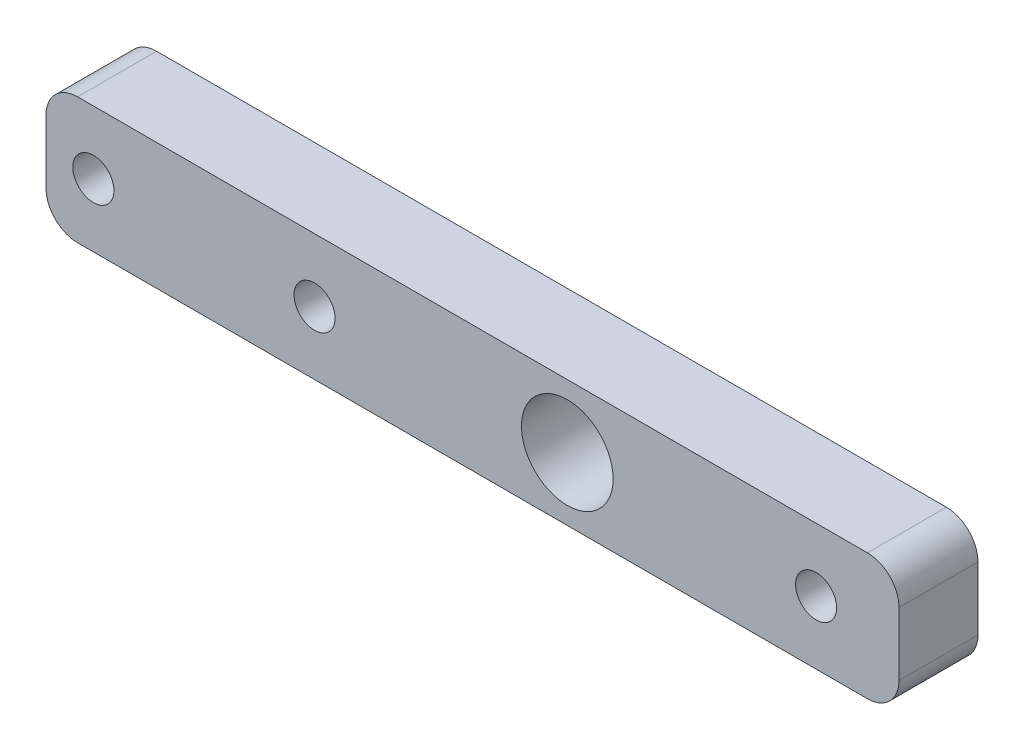
ISO-10303-21;
HEADER;
FILE_DESCRIPTION(('STEP AP214'),'2;1');
FILE_NAME('part.step','',(''),(''),'','','');
FILE_SCHEMA(('AUTOMOTIVE_DESIGN { 1 0 10303 214 1 1 1 1 }'));
ENDSEC;
DATA;
#1=APPLICATION_CONTEXT('core data for automotive mechanical design processes');
#2=APPLICATION_PROTOCOL_DEFINITION('international standard','automotive_design',2000,#1);
#3=PRODUCT_CONTEXT('',#1,'mechanical');
#4=PRODUCT('Part','Part','',(#3));
#5=PRODUCT_RELATED_PRODUCT_CATEGORY('part','',(#4));
#6=PRODUCT_DEFINITION_FORMATION('','',#4);
#7=PRODUCT_DEFINITION_CONTEXT('part definition',#1,'design');
#8=PRODUCT_DEFINITION('design','',#6,#7);
#9=PRODUCT_DEFINITION_SHAPE('','',#8);
#10=(LENGTH_UNIT() NAMED_UNIT(*) SI_UNIT(.MILLI.,.METRE.));
#11=(NAMED_UNIT(*) PLANE_ANGLE_UNIT() SI_UNIT($,.RADIAN.));
#12=(NAMED_UNIT(*) SI_UNIT($,.STERADIAN.) SOLID_ANGLE_UNIT());
#13=UNCERTAINTY_MEASURE_WITH_UNIT(LENGTH_MEASURE(1.E-05),#10,'distance_accuracy_value','');
#14=(GEOMETRIC_REPRESENTATION_CONTEXT(3) GLOBAL_UNCERTAINTY_ASSIGNED_CONTEXT((#13)) GLOBAL_UNIT_ASSIGNED_CONTEXT((#10,
#11,#12)) REPRESENTATION_CONTEXT('',''));
#15=CARTESIAN_POINT('',(0.,0.,0.));
#16=DIRECTION('',(0.,0.,1.));
#17=DIRECTION('',(1.,0.,0.));
#18=AXIS2_PLACEMENT_3D('',#15,#16,#17);
#19=CARTESIAN_POINT('',(-25.,2.,5.));
#20=DIRECTION('',(0.,0.,-1.));
#21=DIRECTION('',(-1.,0.,0.));
#22=AXIS2_PLACEMENT_3D('',#19,#20,#21);
#23=PLANE('',#22);
#24=CARTESIAN_POINT('',(-24.,0.,5.));
#25=DIRECTION('',(0.,0.,1.));
#26=DIRECTION('',(1.,0.,0.));
#27=AXIS2_PLACEMENT_3D('',#24,#25,#26);
#28=CIRCLE('',#27,1.3);
#29=CARTESIAN_POINT('',(-22.7,0.,5.));
#30=VERTEX_POINT('',#29);
#31=EDGE_CURVE('E207',#30,#30,#28,.T.);
#32=ORIENTED_EDGE('',*,*,#31,.F.);
#33=EDGE_LOOP('',(#32));
#34=FACE_BOUND('',#33,.T.);
#35=CARTESIAN_POINT('',(-10.,0.,5.));
#36=DIRECTION('',(0.,0.,1.));
#37=DIRECTION('',(1.,0.,0.));
#38=AXIS2_PLACEMENT_3D('',#35,#36,#37);
#39=CIRCLE('',#38,1.29999999999999);
#40=CARTESIAN_POINT('',(-8.70000000000001,0.,5.));
#41=VERTEX_POINT('',#40);
#42=EDGE_CURVE('E195',#41,#41,#39,.T.);
#43=ORIENTED_EDGE('',*,*,#42,.F.);
#44=EDGE_LOOP('',(#43));
#45=FACE_BOUND('',#44,.T.);
#46=CARTESIAN_POINT('',(-25.,2.,5.));
#47=DIRECTION('',(0.,0.,-1.));
#48=DIRECTION('',(-1.,0.,0.));
#49=AXIS2_PLACEMENT_3D('',#46,#47,#48);
#50=CIRCLE('',#49,2.);
#51=CARTESIAN_POINT('',(-27.,2.,5.));
#52=VERTEX_POINT('',#51);
#53=CARTESIAN_POINT('',(-25.,4.,5.));
#54=VERTEX_POINT('',#53);
#55=EDGE_CURVE('E157',#52,#54,#50,.T.);
#56=ORIENTED_EDGE('',*,*,#55,.F.);
#57=DIRECTION('',(0.,-1.,0.));
#58=VECTOR('',#57,1.);
#59=CARTESIAN_POINT('',(-27.,2.,5.));
#60=LINE('',#59,#58);
#61=CARTESIAN_POINT('',(-27.,-2.,5.));
#62=VERTEX_POINT('',#61);
#63=EDGE_CURVE('E116',#52,#62,#60,.T.);
#64=ORIENTED_EDGE('',*,*,#63,.T.);
#65=CARTESIAN_POINT('',(-25.,-2.,5.));
#66=DIRECTION('',(0.,0.,1.));
#67=DIRECTION('',(1.,0.,0.));
#68=AXIS2_PLACEMENT_3D('',#65,#66,#67);
#69=CIRCLE('',#68,2.);
#70=CARTESIAN_POINT('',(-25.,-4.,5.));
#71=VERTEX_POINT('',#70);
#72=EDGE_CURVE('E109',#62,#71,#69,.T.);
#73=ORIENTED_EDGE('',*,*,#72,.T.);
#74=DIRECTION('',(1.,0.,0.));
#75=VECTOR('',#74,1.);
#76=CARTESIAN_POINT('',(-25.,-4.,5.));
#77=LINE('',#76,#75);
#78=CARTESIAN_POINT('',(25.,-4.,5.));
#79=VERTEX_POINT('',#78);
#80=EDGE_CURVE('E114',#71,#79,#77,.T.);
#81=ORIENTED_EDGE('',*,*,#80,.T.);
#82=CARTESIAN_POINT('',(25.,-2.,5.));
#83=DIRECTION('',(0.,0.,1.));
#84=DIRECTION('',(1.,0.,0.));
#85=AXIS2_PLACEMENT_3D('',#82,#83,#84);
#86=CIRCLE('',#85,2.);
#87=CARTESIAN_POINT('',(27.,-2.,5.));
#88=VERTEX_POINT('',#87);
#89=EDGE_CURVE('E131',#79,#88,#86,.T.);
#90=ORIENTED_EDGE('',*,*,#89,.T.);
#91=DIRECTION('',(0.,-1.,0.));
#92=VECTOR('',#91,1.);
#93=CARTESIAN_POINT('',(27.,2.,5.));
#94=LINE('',#93,#92);
#95=CARTESIAN_POINT('',(27.,2.,5.));
#96=VERTEX_POINT('',#95);
#97=EDGE_CURVE('E133',#96,#88,#94,.T.);
#98=ORIENTED_EDGE('',*,*,#97,.F.);
#99=CARTESIAN_POINT('',(25.,2.,5.));
#100=DIRECTION('',(0.,0.,-1.));
#101=DIRECTION('',(-1.,0.,0.));
#102=AXIS2_PLACEMENT_3D('',#99,#100,#101);
#103=CIRCLE('',#102,2.);
#104=CARTESIAN_POINT('',(25.,4.,5.));
#105=VERTEX_POINT('',#104);
#106=EDGE_CURVE('E177',#105,#96,#103,.T.);
#107=ORIENTED_EDGE('',*,*,#106,.F.);
#108=DIRECTION('',(1.,0.,0.));
#109=VECTOR('',#108,1.);
#110=CARTESIAN_POINT('',(-25.,4.,5.));
#111=LINE('',#110,#109);
#112=EDGE_CURVE('E182',#54,#105,#111,.T.);
#113=ORIENTED_EDGE('',*,*,#112,.F.);
#114=EDGE_LOOP('',(#56,#64,#73,#81,#90,#98,#107,#113));
#115=FACE_BOUND('',#114,.T.);
#116=CARTESIAN_POINT('',(21.75,0.,5.));
#117=DIRECTION('',(0.,0.,1.));
#118=DIRECTION('',(1.,0.,0.));
#119=AXIS2_PLACEMENT_3D('',#116,#117,#118);
#120=CIRCLE('',#119,1.29999999999999);
#121=CARTESIAN_POINT('',(23.05,0.,5.));
#122=VERTEX_POINT('',#121);
#123=EDGE_CURVE('E189',#122,#122,#120,.T.);
#124=ORIENTED_EDGE('',*,*,#123,.F.);
#125=EDGE_LOOP('',(#124));
#126=FACE_BOUND('',#125,.T.);
#127=CARTESIAN_POINT('',(6.,0.,5.));
#128=DIRECTION('',(0.,0.,1.));
#129=DIRECTION('',(1.,0.,0.));
#130=AXIS2_PLACEMENT_3D('',#127,#128,#129);
#131=CIRCLE('',#130,2.9);
#132=CARTESIAN_POINT('',(8.9,0.,5.));
#133=VERTEX_POINT('',#132);
#134=EDGE_CURVE('E201',#133,#133,#131,.T.);
#135=ORIENTED_EDGE('',*,*,#134,.F.);
#136=EDGE_LOOP('',(#135));
#137=FACE_BOUND('',#136,.T.);
#138=ADVANCED_FACE('F39',(#34,#45,#115,#126,#137),#23,.F.);
#139=CARTESIAN_POINT('',(-25.,2.,5.));
#140=DIRECTION('',(0.,0.,-1.));
#141=DIRECTION('',(-1.,0.,0.));
#142=AXIS2_PLACEMENT_3D('',#139,#140,#141);
#143=CYLINDRICAL_SURFACE('',#142,2.);
#144=CARTESIAN_POINT('',(-25.,2.,0.));
#145=DIRECTION('',(0.,0.,-1.));
#146=DIRECTION('',(-1.,0.,0.));
#147=AXIS2_PLACEMENT_3D('',#144,#145,#146);
#148=CIRCLE('',#147,2.);
#149=CARTESIAN_POINT('',(-27.,2.,0.));
#150=VERTEX_POINT('',#149);
#151=CARTESIAN_POINT('',(-25.,4.,0.));
#152=VERTEX_POINT('',#151);
#153=EDGE_CURVE('E138',#150,#152,#148,.T.);
#154=ORIENTED_EDGE('',*,*,#153,.F.);
#155=DIRECTION('',(0.,0.,-1.));
#156=VECTOR('',#155,1.);
#157=CARTESIAN_POINT('',(-27.,2.,5.));
#158=LINE('',#157,#156);
#159=EDGE_CURVE('E11',#52,#150,#158,.T.);
#160=ORIENTED_EDGE('',*,*,#159,.F.);
#161=ORIENTED_EDGE('',*,*,#55,.T.);
#162=DIRECTION('',(0.,0.,-1.));
#163=VECTOR('',#162,1.);
#164=CARTESIAN_POINT('',(-25.,4.,5.));
#165=LINE('',#164,#163);
#166=EDGE_CURVE('E43',#54,#152,#165,.T.);
#167=ORIENTED_EDGE('',*,*,#166,.T.);
#168=EDGE_LOOP('',(#154,#160,#161,#167));
#169=FACE_BOUND('',#168,.T.);
#170=ADVANCED_FACE('F41',(#169),#143,.T.);
#171=CARTESIAN_POINT('',(-27.,2.,5.));
#172=DIRECTION('',(1.,0.,0.));
#173=DIRECTION('',(0.,0.,-1.));
#174=AXIS2_PLACEMENT_3D('',#171,#172,#173);
#175=PLANE('',#174);
#176=DIRECTION('',(0.,-1.,0.));
#177=VECTOR('',#176,1.);
#178=CARTESIAN_POINT('',(-27.,2.,0.));
#179=LINE('',#178,#177);
#180=CARTESIAN_POINT('',(-27.,-2.,0.));
#181=VERTEX_POINT('',#180);
#182=EDGE_CURVE('E85',#150,#181,#179,.T.);
#183=ORIENTED_EDGE('',*,*,#182,.T.);
#184=DIRECTION('',(0.,0.,-1.));
#185=VECTOR('',#184,1.);
#186=CARTESIAN_POINT('',(-27.,-2.,5.));
#187=LINE('',#186,#185);
#188=EDGE_CURVE('E49',#62,#181,#187,.T.);
#189=ORIENTED_EDGE('',*,*,#188,.F.);
#190=ORIENTED_EDGE('',*,*,#63,.F.);
#191=ORIENTED_EDGE('',*,*,#159,.T.);
#192=EDGE_LOOP('',(#183,#189,#190,#191));
#193=FACE_BOUND('',#192,.T.);
#194=ADVANCED_FACE('F240',(#193),#175,.F.);
#195=CARTESIAN_POINT('',(-25.,-2.,5.));
#196=DIRECTION('',(0.,0.,-1.));
#197=DIRECTION('',(-1.,0.,0.));
#198=AXIS2_PLACEMENT_3D('',#195,#196,#197);
#199=CYLINDRICAL_SURFACE('',#198,2.);
#200=CARTESIAN_POINT('',(-25.,-2.,0.));
#201=DIRECTION('',(0.,0.,1.));
#202=DIRECTION('',(1.,0.,0.));
#203=AXIS2_PLACEMENT_3D('',#200,#201,#202);
#204=CIRCLE('',#203,2.);
#205=CARTESIAN_POINT('',(-25.,-4.,0.));
#206=VERTEX_POINT('',#205);
#207=EDGE_CURVE('E123',#181,#206,#204,.T.);
#208=ORIENTED_EDGE('',*,*,#207,.T.);
#209=DIRECTION('',(0.,0.,-1.));
#210=VECTOR('',#209,1.);
#211=CARTESIAN_POINT('',(-25.,-4.,5.));
#212=LINE('',#211,#210);
#213=EDGE_CURVE('E120',#71,#206,#212,.T.);
#214=ORIENTED_EDGE('',*,*,#213,.F.);
#215=ORIENTED_EDGE('',*,*,#72,.F.);
#216=ORIENTED_EDGE('',*,*,#188,.T.);
#217=EDGE_LOOP('',(#208,#214,#215,#216));
#218=FACE_BOUND('',#217,.T.);
#219=ADVANCED_FACE('F121',(#218),#199,.T.);
#220=CARTESIAN_POINT('',(-25.,-4.,5.));
#221=DIRECTION('',(0.,1.,0.));
#222=DIRECTION('',(0.,0.,1.));
#223=AXIS2_PLACEMENT_3D('',#220,#221,#222);
#224=PLANE('',#223);
#225=DIRECTION('',(1.,0.,0.));
#226=VECTOR('',#225,1.);
#227=CARTESIAN_POINT('',(-25.,-4.,0.));
#228=LINE('',#227,#226);
#229=CARTESIAN_POINT('',(25.,-4.,0.));
#230=VERTEX_POINT('',#229);
#231=EDGE_CURVE('E154',#206,#230,#228,.T.);
#232=ORIENTED_EDGE('',*,*,#231,.T.);
#233=DIRECTION('',(0.,0.,-1.));
#234=VECTOR('',#233,1.);
#235=CARTESIAN_POINT('',(25.,-4.,5.));
#236=LINE('',#235,#234);
#237=EDGE_CURVE('E126',#79,#230,#236,.T.);
#238=ORIENTED_EDGE('',*,*,#237,.F.);
#239=ORIENTED_EDGE('',*,*,#80,.F.);
#240=ORIENTED_EDGE('',*,*,#213,.T.);
#241=EDGE_LOOP('',(#232,#238,#239,#240));
#242=FACE_BOUND('',#241,.T.);
#243=ADVANCED_FACE('F128',(#242),#224,.F.);
#244=CARTESIAN_POINT('',(25.,-2.,5.));
#245=DIRECTION('',(0.,0.,-1.));
#246=DIRECTION('',(-1.,0.,0.));
#247=AXIS2_PLACEMENT_3D('',#244,#245,#246);
#248=CYLINDRICAL_SURFACE('',#247,2.);
#249=CARTESIAN_POINT('',(25.,-2.,0.));
#250=DIRECTION('',(0.,0.,1.));
#251=DIRECTION('',(1.,0.,0.));
#252=AXIS2_PLACEMENT_3D('',#249,#250,#251);
#253=CIRCLE('',#252,2.);
#254=CARTESIAN_POINT('',(27.,-2.,0.));
#255=VERTEX_POINT('',#254);
#256=EDGE_CURVE('E151',#230,#255,#253,.T.);
#257=ORIENTED_EDGE('',*,*,#256,.T.);
#258=DIRECTION('',(0.,0.,-1.));
#259=VECTOR('',#258,1.);
#260=CARTESIAN_POINT('',(27.,-2.,5.));
#261=LINE('',#260,#259);
#262=EDGE_CURVE('E161',#88,#255,#261,.T.);
#263=ORIENTED_EDGE('',*,*,#262,.F.);
#264=ORIENTED_EDGE('',*,*,#89,.F.);
#265=ORIENTED_EDGE('',*,*,#237,.T.);
#266=EDGE_LOOP('',(#257,#263,#264,#265));
#267=FACE_BOUND('',#266,.T.);
#268=ADVANCED_FACE('F171',(#267),#248,.T.);
#269=CARTESIAN_POINT('',(27.,2.,5.));
#270=DIRECTION('',(1.,0.,0.));
#271=DIRECTION('',(0.,0.,-1.));
#272=AXIS2_PLACEMENT_3D('',#269,#270,#271);
#273=PLANE('',#272);
#274=DIRECTION('',(0.,-1.,0.));
#275=VECTOR('',#274,1.);
#276=CARTESIAN_POINT('',(27.,2.,0.));
#277=LINE('',#276,#275);
#278=CARTESIAN_POINT('',(27.,2.,0.));
#279=VERTEX_POINT('',#278);
#280=EDGE_CURVE('E148',#279,#255,#277,.T.);
#281=ORIENTED_EDGE('',*,*,#280,.F.);
#282=DIRECTION('',(0.,0.,-1.));
#283=VECTOR('',#282,1.);
#284=CARTESIAN_POINT('',(27.,2.,5.));
#285=LINE('',#284,#283);
#286=EDGE_CURVE('E163',#96,#279,#285,.T.);
#287=ORIENTED_EDGE('',*,*,#286,.F.);
#288=ORIENTED_EDGE('',*,*,#97,.T.);
#289=ORIENTED_EDGE('',*,*,#262,.T.);
#290=EDGE_LOOP('',(#281,#287,#288,#289));
#291=FACE_BOUND('',#290,.T.);
#292=ADVANCED_FACE('F249',(#291),#273,.T.);
#293=CARTESIAN_POINT('',(25.,2.,5.));
#294=DIRECTION('',(0.,0.,-1.));
#295=DIRECTION('',(-1.,0.,0.));
#296=AXIS2_PLACEMENT_3D('',#293,#294,#295);
#297=CYLINDRICAL_SURFACE('',#296,2.);
#298=CARTESIAN_POINT('',(25.,2.,0.));
#299=DIRECTION('',(0.,0.,-1.));
#300=DIRECTION('',(-1.,0.,0.));
#301=AXIS2_PLACEMENT_3D('',#298,#299,#300);
#302=CIRCLE('',#301,2.);
#303=CARTESIAN_POINT('',(25.,4.,0.));
#304=VERTEX_POINT('',#303);
#305=EDGE_CURVE('E145',#304,#279,#302,.T.);
#306=ORIENTED_EDGE('',*,*,#305,.F.);
#307=DIRECTION('',(0.,0.,-1.));
#308=VECTOR('',#307,1.);
#309=CARTESIAN_POINT('',(25.,4.,5.));
#310=LINE('',#309,#308);
#311=EDGE_CURVE('E164',#105,#304,#310,.T.);
#312=ORIENTED_EDGE('',*,*,#311,.F.);
#313=ORIENTED_EDGE('',*,*,#106,.T.);
#314=ORIENTED_EDGE('',*,*,#286,.T.);
#315=EDGE_LOOP('',(#306,#312,#313,#314));
#316=FACE_BOUND('',#315,.T.);
#317=ADVANCED_FACE('F180',(#316),#297,.T.);
#318=CARTESIAN_POINT('',(-25.,4.,5.));
#319=DIRECTION('',(0.,1.,0.));
#320=DIRECTION('',(0.,0.,1.));
#321=AXIS2_PLACEMENT_3D('',#318,#319,#320);
#322=PLANE('',#321);
#323=DIRECTION('',(1.,0.,0.));
#324=VECTOR('',#323,1.);
#325=CARTESIAN_POINT('',(-25.,4.,0.));
#326=LINE('',#325,#324);
#327=EDGE_CURVE('E141',#152,#304,#326,.T.);
#328=ORIENTED_EDGE('',*,*,#327,.F.);
#329=ORIENTED_EDGE('',*,*,#166,.F.);
#330=ORIENTED_EDGE('',*,*,#112,.T.);
#331=ORIENTED_EDGE('',*,*,#311,.T.);
#332=EDGE_LOOP('',(#328,#329,#330,#331));
#333=FACE_BOUND('',#332,.T.);
#334=ADVANCED_FACE('F166',(#333),#322,.T.);
#335=CARTESIAN_POINT('',(-25.,2.,0.));
#336=DIRECTION('',(0.,0.,-1.));
#337=DIRECTION('',(-1.,0.,0.));
#338=AXIS2_PLACEMENT_3D('',#335,#336,#337);
#339=PLANE('',#338);
#340=CARTESIAN_POINT('',(-24.,0.,0.));
#341=DIRECTION('',(0.,0.,-1.));
#342=DIRECTION('',(-1.,0.,0.));
#343=AXIS2_PLACEMENT_3D('',#340,#341,#342);
#344=CIRCLE('',#343,1.3);
#345=CARTESIAN_POINT('',(-25.3,0.,0.));
#346=VERTEX_POINT('',#345);
#347=EDGE_CURVE('E204',#346,#346,#344,.T.);
#348=ORIENTED_EDGE('',*,*,#347,.F.);
#349=EDGE_LOOP('',(#348));
#350=FACE_BOUND('',#349,.T.);
#351=CARTESIAN_POINT('',(6.,0.,0.));
#352=DIRECTION('',(0.,0.,-1.));
#353=DIRECTION('',(-1.,0.,0.));
#354=AXIS2_PLACEMENT_3D('',#351,#352,#353);
#355=CIRCLE('',#354,2.9);
#356=CARTESIAN_POINT('',(3.1,0.,0.));
#357=VERTEX_POINT('',#356);
#358=EDGE_CURVE('E198',#357,#357,#355,.T.);
#359=ORIENTED_EDGE('',*,*,#358,.F.);
#360=EDGE_LOOP('',(#359));
#361=FACE_BOUND('',#360,.T.);
#362=CARTESIAN_POINT('',(-10.,0.,0.));
#363=DIRECTION('',(0.,0.,-1.));
#364=DIRECTION('',(-1.,0.,0.));
#365=AXIS2_PLACEMENT_3D('',#362,#363,#364);
#366=CIRCLE('',#365,1.29999999999999);
#367=CARTESIAN_POINT('',(-11.3,0.,0.));
#368=VERTEX_POINT('',#367);
#369=EDGE_CURVE('E192',#368,#368,#366,.T.);
#370=ORIENTED_EDGE('',*,*,#369,.F.);
#371=EDGE_LOOP('',(#370));
#372=FACE_BOUND('',#371,.T.);
#373=CARTESIAN_POINT('',(21.75,0.,0.));
#374=DIRECTION('',(0.,0.,-1.));
#375=DIRECTION('',(-1.,0.,0.));
#376=AXIS2_PLACEMENT_3D('',#373,#374,#375);
#377=CIRCLE('',#376,1.29999999999999);
#378=CARTESIAN_POINT('',(20.45,0.,0.));
#379=VERTEX_POINT('',#378);
#380=EDGE_CURVE('E142',#379,#379,#377,.T.);
#381=ORIENTED_EDGE('',*,*,#380,.F.);
#382=EDGE_LOOP('',(#381));
#383=FACE_BOUND('',#382,.T.);
#384=ORIENTED_EDGE('',*,*,#153,.T.);
#385=ORIENTED_EDGE('',*,*,#327,.T.);
#386=ORIENTED_EDGE('',*,*,#305,.T.);
#387=ORIENTED_EDGE('',*,*,#280,.T.);
#388=ORIENTED_EDGE('',*,*,#256,.F.);
#389=ORIENTED_EDGE('',*,*,#231,.F.);
#390=ORIENTED_EDGE('',*,*,#207,.F.);
#391=ORIENTED_EDGE('',*,*,#182,.F.);
#392=EDGE_LOOP('',(#384,#385,#386,#387,#388,#389,#390,#391));
#393=FACE_BOUND('',#392,.T.);
#394=ADVANCED_FACE('F168',(#350,#361,#372,#383,#393),#339,.T.);
#395=CARTESIAN_POINT('',(21.75,0.,5.));
#396=DIRECTION('',(0.,0.,1.));
#397=DIRECTION('',(1.,0.,0.));
#398=AXIS2_PLACEMENT_3D('',#395,#396,#397);
#399=CYLINDRICAL_SURFACE('',#398,1.29999999999999);
#400=ORIENTED_EDGE('',*,*,#123,.T.);
#401=EDGE_LOOP('',(#400));
#402=FACE_BOUND('',#401,.T.);
#403=ORIENTED_EDGE('',*,*,#380,.T.);
#404=EDGE_LOOP('',(#403));
#405=FACE_BOUND('',#404,.T.);
#406=ADVANCED_FACE('F223',(#402,#405),#399,.F.);
#407=CARTESIAN_POINT('',(-10.,0.,5.));
#408=DIRECTION('',(0.,0.,1.));
#409=DIRECTION('',(1.,0.,0.));
#410=AXIS2_PLACEMENT_3D('',#407,#408,#409);
#411=CYLINDRICAL_SURFACE('',#410,1.29999999999999);
#412=ORIENTED_EDGE('',*,*,#42,.T.);
#413=EDGE_LOOP('',(#412));
#414=FACE_BOUND('',#413,.T.);
#415=ORIENTED_EDGE('',*,*,#369,.T.);
#416=EDGE_LOOP('',(#415));
#417=FACE_BOUND('',#416,.T.);
#418=ADVANCED_FACE('F219',(#414,#417),#411,.F.);
#419=CARTESIAN_POINT('',(6.,0.,5.));
#420=DIRECTION('',(0.,0.,1.));
#421=DIRECTION('',(1.,0.,0.));
#422=AXIS2_PLACEMENT_3D('',#419,#420,#421);
#423=CYLINDRICAL_SURFACE('',#422,2.9);
#424=ORIENTED_EDGE('',*,*,#134,.T.);
#425=EDGE_LOOP('',(#424));
#426=FACE_BOUND('',#425,.T.);
#427=ORIENTED_EDGE('',*,*,#358,.T.);
#428=EDGE_LOOP('',(#427));
#429=FACE_BOUND('',#428,.T.);
#430=ADVANCED_FACE('F222',(#426,#429),#423,.F.);
#431=CARTESIAN_POINT('',(-24.,0.,5.));
#432=DIRECTION('',(0.,0.,1.));
#433=DIRECTION('',(1.,0.,0.));
#434=AXIS2_PLACEMENT_3D('',#431,#432,#433);
#435=CYLINDRICAL_SURFACE('',#434,1.3);
#436=ORIENTED_EDGE('',*,*,#31,.T.);
#437=EDGE_LOOP('',(#436));
#438=FACE_BOUND('',#437,.T.);
#439=ORIENTED_EDGE('',*,*,#347,.T.);
#440=EDGE_LOOP('',(#439));
#441=FACE_BOUND('',#440,.T.);
#442=ADVANCED_FACE('F211',(#438,#441),#435,.F.);
#443=CLOSED_SHELL('',(#138,#170,#194,#219,#243,#268,#292,#317,#334,#394,#406,#418,#430,#442));
#444=MANIFOLD_SOLID_BREP('B2',#443);
#445=ADVANCED_BREP_SHAPE_REPRESENTATION('',(#18,#444),#14);
#446=SHAPE_DEFINITION_REPRESENTATION(#9,#445);
ENDSEC;
END-ISO-10303-21;
